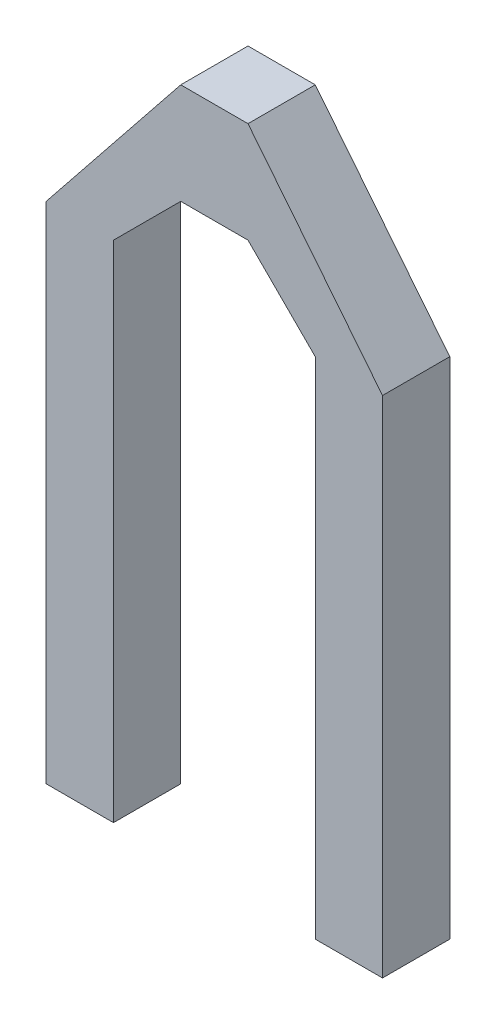
ISO-10303-21;
HEADER;
FILE_DESCRIPTION(('STEP AP214'),'2;1');
FILE_NAME('part.step','',(''),(''),'','','');
FILE_SCHEMA(('AUTOMOTIVE_DESIGN { 1 0 10303 214 1 1 1 1 }'));
ENDSEC;
DATA;
#1=APPLICATION_CONTEXT('core data for automotive mechanical design processes');
#2=APPLICATION_PROTOCOL_DEFINITION('international standard','automotive_design',2000,#1);
#3=PRODUCT_CONTEXT('',#1,'mechanical');
#4=PRODUCT('Part','Part','',(#3));
#5=PRODUCT_RELATED_PRODUCT_CATEGORY('part','',(#4));
#6=PRODUCT_DEFINITION_FORMATION('','',#4);
#7=PRODUCT_DEFINITION_CONTEXT('part definition',#1,'design');
#8=PRODUCT_DEFINITION('design','',#6,#7);
#9=PRODUCT_DEFINITION_SHAPE('','',#8);
#10=(LENGTH_UNIT() NAMED_UNIT(*) SI_UNIT(.MILLI.,.METRE.));
#11=(NAMED_UNIT(*) PLANE_ANGLE_UNIT() SI_UNIT($,.RADIAN.));
#12=(NAMED_UNIT(*) SI_UNIT($,.STERADIAN.) SOLID_ANGLE_UNIT());
#13=UNCERTAINTY_MEASURE_WITH_UNIT(LENGTH_MEASURE(1.E-05),#10,'distance_accuracy_value','');
#14=(GEOMETRIC_REPRESENTATION_CONTEXT(3) GLOBAL_UNCERTAINTY_ASSIGNED_CONTEXT((#13)) GLOBAL_UNIT_ASSIGNED_CONTEXT((#10,
#11,#12)) REPRESENTATION_CONTEXT('',''));
#15=CARTESIAN_POINT('',(0.,0.,0.));
#16=DIRECTION('',(0.,0.,1.));
#17=DIRECTION('',(1.,0.,0.));
#18=AXIS2_PLACEMENT_3D('',#15,#16,#17);
#19=CARTESIAN_POINT('',(0.0635,-0.127,0.0254));
#20=DIRECTION('',(0.,0.,1.));
#21=DIRECTION('',(1.,0.,0.));
#22=AXIS2_PLACEMENT_3D('',#19,#20,#21);
#23=PLANE('',#22);
#24=DIRECTION('',(0.,1.,0.));
#25=VECTOR('',#24,1.);
#26=CARTESIAN_POINT('',(0.0381,-0.127,0.0254));
#27=LINE('',#26,#25);
#28=CARTESIAN_POINT('',(0.0381,-0.127,0.0254));
#29=VERTEX_POINT('',#28);
#30=CARTESIAN_POINT('',(0.0381,0.06349999999998,0.0254));
#31=VERTEX_POINT('',#30);
#32=EDGE_CURVE('E157',#29,#31,#27,.T.);
#33=ORIENTED_EDGE('',*,*,#32,.F.);
#34=DIRECTION('',(1.,0.,0.));
#35=VECTOR('',#34,1.);
#36=CARTESIAN_POINT('',(0.0635,-0.127,0.0254));
#37=LINE('',#36,#35);
#38=CARTESIAN_POINT('',(0.0635,-0.127,0.0254));
#39=VERTEX_POINT('',#38);
#40=EDGE_CURVE('E118',#39,#29,#37,.F.);
#41=ORIENTED_EDGE('',*,*,#40,.F.);
#42=DIRECTION('',(0.,1.,0.));
#43=VECTOR('',#42,1.);
#44=CARTESIAN_POINT('',(0.0635,0.06349999999998,0.0254));
#45=LINE('',#44,#43);
#46=CARTESIAN_POINT('',(0.0634999999999975,0.063499999999978,0.0254));
#47=VERTEX_POINT('',#46);
#48=EDGE_CURVE('E20',#47,#39,#45,.F.);
#49=ORIENTED_EDGE('',*,*,#48,.F.);
#50=DIRECTION('',(-0.62469504755418,0.780868809443225,0.));
#51=VECTOR('',#50,1.);
#52=CARTESIAN_POINT('',(0.0127,0.127,0.0254));
#53=LINE('',#52,#51);
#54=CARTESIAN_POINT('',(0.0127,0.127,0.0254));
#55=VERTEX_POINT('',#54);
#56=EDGE_CURVE('E107',#55,#47,#53,.F.);
#57=ORIENTED_EDGE('',*,*,#56,.F.);
#58=DIRECTION('',(1.,0.,0.));
#59=VECTOR('',#58,1.);
#60=CARTESIAN_POINT('',(-0.0127,0.127,0.0254));
#61=LINE('',#60,#59);
#62=CARTESIAN_POINT('',(-0.0127000000000025,0.127000000000002,0.0254));
#63=VERTEX_POINT('',#62);
#64=EDGE_CURVE('E102',#63,#55,#61,.T.);
#65=ORIENTED_EDGE('',*,*,#64,.F.);
#66=DIRECTION('',(-0.62469504755418,-0.780868809443225,0.));
#67=VECTOR('',#66,1.);
#68=CARTESIAN_POINT('',(-0.0635,0.06349999999998,0.0254));
#69=LINE('',#68,#67);
#70=CARTESIAN_POINT('',(-0.0635,0.06349999999998,0.0254));
#71=VERTEX_POINT('',#70);
#72=EDGE_CURVE('E129',#71,#63,#69,.F.);
#73=ORIENTED_EDGE('',*,*,#72,.F.);
#74=DIRECTION('',(0.,1.,0.));
#75=VECTOR('',#74,1.);
#76=CARTESIAN_POINT('',(-0.0635,-0.127,0.0254));
#77=LINE('',#76,#75);
#78=CARTESIAN_POINT('',(-0.0635,-0.127,0.0254));
#79=VERTEX_POINT('',#78);
#80=EDGE_CURVE('E133',#79,#71,#77,.T.);
#81=ORIENTED_EDGE('',*,*,#80,.F.);
#82=DIRECTION('',(1.,0.,0.));
#83=VECTOR('',#82,1.);
#84=CARTESIAN_POINT('',(-0.0381,-0.127,0.0254));
#85=LINE('',#84,#83);
#86=CARTESIAN_POINT('',(-0.0381,-0.127,0.0254));
#87=VERTEX_POINT('',#86);
#88=EDGE_CURVE('E137',#87,#79,#85,.F.);
#89=ORIENTED_EDGE('',*,*,#88,.F.);
#90=DIRECTION('',(0.,1.,0.));
#91=VECTOR('',#90,1.);
#92=CARTESIAN_POINT('',(-0.0381,0.06349999999998,0.0254));
#93=LINE('',#92,#91);
#94=CARTESIAN_POINT('',(-0.038099999999998,0.063499999999978,0.0254));
#95=VERTEX_POINT('',#94);
#96=EDGE_CURVE('E141',#95,#87,#93,.F.);
#97=ORIENTED_EDGE('',*,*,#96,.F.);
#98=DIRECTION('',(0.707106781186048,0.707106781187048,0.));
#99=VECTOR('',#98,1.);
#100=CARTESIAN_POINT('',(-0.0127,0.0889,0.0254));
#101=LINE('',#100,#99);
#102=CARTESIAN_POINT('',(-0.0127,0.0889,0.0254));
#103=VERTEX_POINT('',#102);
#104=EDGE_CURVE('E145',#103,#95,#101,.F.);
#105=ORIENTED_EDGE('',*,*,#104,.F.);
#106=DIRECTION('',(1.,0.,0.));
#107=VECTOR('',#106,1.);
#108=CARTESIAN_POINT('',(0.0127,0.0889,0.0254));
#109=LINE('',#108,#107);
#110=CARTESIAN_POINT('',(0.012700000000002,0.088900000000002,0.0254));
#111=VERTEX_POINT('',#110);
#112=EDGE_CURVE('E149',#111,#103,#109,.F.);
#113=ORIENTED_EDGE('',*,*,#112,.F.);
#114=DIRECTION('',(0.707106781186048,-0.707106781187048,0.));
#115=VECTOR('',#114,1.);
#116=CARTESIAN_POINT('',(0.0381,0.06349999999998,0.0254));
#117=LINE('',#116,#115);
#118=EDGE_CURVE('E153',#31,#111,#117,.F.);
#119=ORIENTED_EDGE('',*,*,#118,.F.);
#120=EDGE_LOOP('',(#33,#41,#49,#57,#65,#73,#81,#89,#97,#105,#113,#119));
#121=FACE_BOUND('',#120,.T.);
#122=ADVANCED_FACE('F17',(#121),#23,.T.);
#123=CARTESIAN_POINT('',(0.0635,0.06349999999998,0.));
#124=DIRECTION('',(1.,0.,0.));
#125=DIRECTION('',(0.,0.,-1.));
#126=AXIS2_PLACEMENT_3D('',#123,#124,#125);
#127=PLANE('',#126);
#128=DIRECTION('',(0.,0.,-1.));
#129=VECTOR('',#128,1.);
#130=CARTESIAN_POINT('',(0.0635,-0.127,0.));
#131=LINE('',#130,#129);
#132=CARTESIAN_POINT('',(0.0635,-0.127,0.));
#133=VERTEX_POINT('',#132);
#134=EDGE_CURVE('E161',#133,#39,#131,.F.);
#135=ORIENTED_EDGE('',*,*,#134,.F.);
#136=DIRECTION('',(0.,1.,0.));
#137=VECTOR('',#136,1.);
#138=CARTESIAN_POINT('',(0.0635,-0.127,0.));
#139=LINE('',#138,#137);
#140=CARTESIAN_POINT('',(0.0634999999999975,0.063499999999978,0.));
#141=VERTEX_POINT('',#140);
#142=EDGE_CURVE('E124',#133,#141,#139,.T.);
#143=ORIENTED_EDGE('',*,*,#142,.T.);
#144=DIRECTION('',(0.,0.,1.));
#145=VECTOR('',#144,1.);
#146=CARTESIAN_POINT('',(0.0634999999999899,0.0634999999999719,0.));
#147=LINE('',#146,#145);
#148=EDGE_CURVE('E112',#47,#141,#147,.F.);
#149=ORIENTED_EDGE('',*,*,#148,.F.);
#150=ORIENTED_EDGE('',*,*,#48,.T.);
#151=EDGE_LOOP('',(#135,#143,#149,#150));
#152=FACE_BOUND('',#151,.T.);
#153=ADVANCED_FACE('F123',(#152),#127,.T.);
#154=CARTESIAN_POINT('',(0.0127,0.127,0.));
#155=DIRECTION('',(0.780868809443225,0.62469504755418,0.));
#156=DIRECTION('',(-0.62469504755418,0.780868809443225,0.));
#157=AXIS2_PLACEMENT_3D('',#154,#155,#156);
#158=PLANE('',#157);
#159=ORIENTED_EDGE('',*,*,#148,.T.);
#160=DIRECTION('',(-0.624695047554304,0.780868809443126,0.));
#161=VECTOR('',#160,1.);
#162=CARTESIAN_POINT('',(0.0635,0.06349999999998,0.));
#163=LINE('',#162,#161);
#164=CARTESIAN_POINT('',(0.0127,0.127,0.));
#165=VERTEX_POINT('',#164);
#166=EDGE_CURVE('E166',#141,#165,#163,.T.);
#167=ORIENTED_EDGE('',*,*,#166,.T.);
#168=DIRECTION('',(0.,0.,1.));
#169=VECTOR('',#168,1.);
#170=CARTESIAN_POINT('',(0.0127,0.127,0.));
#171=LINE('',#170,#169);
#172=EDGE_CURVE('E114',#55,#165,#171,.F.);
#173=ORIENTED_EDGE('',*,*,#172,.F.);
#174=ORIENTED_EDGE('',*,*,#56,.T.);
#175=EDGE_LOOP('',(#159,#167,#173,#174));
#176=FACE_BOUND('',#175,.T.);
#177=ADVANCED_FACE('F109',(#176),#158,.T.);
#178=CARTESIAN_POINT('',(-0.0127,0.127,0.));
#179=DIRECTION('',(0.,1.,0.));
#180=DIRECTION('',(0.,0.,1.));
#181=AXIS2_PLACEMENT_3D('',#178,#179,#180);
#182=PLANE('',#181);
#183=ORIENTED_EDGE('',*,*,#172,.T.);
#184=DIRECTION('',(1.,0.,0.));
#185=VECTOR('',#184,1.);
#186=CARTESIAN_POINT('',(0.0635,0.127,0.));
#187=LINE('',#186,#185);
#188=CARTESIAN_POINT('',(-0.0127000000000025,0.127000000000002,0.));
#189=VERTEX_POINT('',#188);
#190=EDGE_CURVE('E168',#165,#189,#187,.F.);
#191=ORIENTED_EDGE('',*,*,#190,.T.);
#192=DIRECTION('',(0.,0.,1.));
#193=VECTOR('',#192,1.);
#194=CARTESIAN_POINT('',(-0.0127000000000101,0.127000000000008,0.));
#195=LINE('',#194,#193);
#196=EDGE_CURVE('E131',#63,#189,#195,.F.);
#197=ORIENTED_EDGE('',*,*,#196,.F.);
#198=ORIENTED_EDGE('',*,*,#64,.T.);
#199=EDGE_LOOP('',(#183,#191,#197,#198));
#200=FACE_BOUND('',#199,.T.);
#201=ADVANCED_FACE('F234',(#200),#182,.T.);
#202=CARTESIAN_POINT('',(-0.0635,0.06349999999998,0.));
#203=DIRECTION('',(-0.780868809443225,0.62469504755418,0.));
#204=DIRECTION('',(-0.62469504755418,-0.780868809443225,0.));
#205=AXIS2_PLACEMENT_3D('',#202,#203,#204);
#206=PLANE('',#205);
#207=ORIENTED_EDGE('',*,*,#196,.T.);
#208=DIRECTION('',(-0.624695047554304,-0.780868809443126,0.));
#209=VECTOR('',#208,1.);
#210=CARTESIAN_POINT('',(-0.0127,0.127,0.));
#211=LINE('',#210,#209);
#212=CARTESIAN_POINT('',(-0.0635,0.06349999999998,0.));
#213=VERTEX_POINT('',#212);
#214=EDGE_CURVE('E171',#189,#213,#211,.T.);
#215=ORIENTED_EDGE('',*,*,#214,.T.);
#216=DIRECTION('',(0.,0.,1.));
#217=VECTOR('',#216,1.);
#218=CARTESIAN_POINT('',(-0.0635,0.06349999999998,0.));
#219=LINE('',#218,#217);
#220=EDGE_CURVE('E135',#71,#213,#219,.F.);
#221=ORIENTED_EDGE('',*,*,#220,.F.);
#222=ORIENTED_EDGE('',*,*,#72,.T.);
#223=EDGE_LOOP('',(#207,#215,#221,#222));
#224=FACE_BOUND('',#223,.T.);
#225=ADVANCED_FACE('F233',(#224),#206,.T.);
#226=CARTESIAN_POINT('',(-0.0635,-0.127,0.));
#227=DIRECTION('',(-1.,0.,0.));
#228=DIRECTION('',(0.,0.,1.));
#229=AXIS2_PLACEMENT_3D('',#226,#227,#228);
#230=PLANE('',#229);
#231=ORIENTED_EDGE('',*,*,#220,.T.);
#232=DIRECTION('',(0.,1.,0.));
#233=VECTOR('',#232,1.);
#234=CARTESIAN_POINT('',(-0.0635,-0.127,0.));
#235=LINE('',#234,#233);
#236=CARTESIAN_POINT('',(-0.0635,-0.127,0.));
#237=VERTEX_POINT('',#236);
#238=EDGE_CURVE('E174',#213,#237,#235,.F.);
#239=ORIENTED_EDGE('',*,*,#238,.T.);
#240=DIRECTION('',(0.,0.,-1.));
#241=VECTOR('',#240,1.);
#242=CARTESIAN_POINT('',(-0.0635,-0.127,0.));
#243=LINE('',#242,#241);
#244=EDGE_CURVE('E139',#79,#237,#243,.T.);
#245=ORIENTED_EDGE('',*,*,#244,.F.);
#246=ORIENTED_EDGE('',*,*,#80,.T.);
#247=EDGE_LOOP('',(#231,#239,#245,#246));
#248=FACE_BOUND('',#247,.T.);
#249=ADVANCED_FACE('F227',(#248),#230,.T.);
#250=CARTESIAN_POINT('',(-0.0381,-0.127,0.));
#251=DIRECTION('',(0.,-1.,0.));
#252=DIRECTION('',(0.,0.,-1.));
#253=AXIS2_PLACEMENT_3D('',#250,#251,#252);
#254=PLANE('',#253);
#255=ORIENTED_EDGE('',*,*,#244,.T.);
#256=DIRECTION('',(1.,0.,0.));
#257=VECTOR('',#256,1.);
#258=CARTESIAN_POINT('',(0.0635,-0.127,0.));
#259=LINE('',#258,#257);
#260=CARTESIAN_POINT('',(-0.0381,-0.127,0.));
#261=VERTEX_POINT('',#260);
#262=EDGE_CURVE('E177',#237,#261,#259,.T.);
#263=ORIENTED_EDGE('',*,*,#262,.T.);
#264=DIRECTION('',(0.,0.,-1.));
#265=VECTOR('',#264,1.);
#266=CARTESIAN_POINT('',(-0.0381,-0.127,0.));
#267=LINE('',#266,#265);
#268=EDGE_CURVE('E143',#87,#261,#267,.T.);
#269=ORIENTED_EDGE('',*,*,#268,.F.);
#270=ORIENTED_EDGE('',*,*,#88,.T.);
#271=EDGE_LOOP('',(#255,#263,#269,#270));
#272=FACE_BOUND('',#271,.T.);
#273=ADVANCED_FACE('F223',(#272),#254,.T.);
#274=CARTESIAN_POINT('',(-0.0381,0.06349999999998,0.));
#275=DIRECTION('',(1.,0.,0.));
#276=DIRECTION('',(0.,0.,-1.));
#277=AXIS2_PLACEMENT_3D('',#274,#275,#276);
#278=PLANE('',#277);
#279=ORIENTED_EDGE('',*,*,#268,.T.);
#280=DIRECTION('',(0.,1.,0.));
#281=VECTOR('',#280,1.);
#282=CARTESIAN_POINT('',(-0.0381,-0.127,0.));
#283=LINE('',#282,#281);
#284=CARTESIAN_POINT('',(-0.038099999999998,0.063499999999978,0.));
#285=VERTEX_POINT('',#284);
#286=EDGE_CURVE('E180',#261,#285,#283,.T.);
#287=ORIENTED_EDGE('',*,*,#286,.T.);
#288=DIRECTION('',(0.,0.,1.));
#289=VECTOR('',#288,1.);
#290=CARTESIAN_POINT('',(-0.038099999999992,0.063499999999972,0.));
#291=LINE('',#290,#289);
#292=EDGE_CURVE('E147',#95,#285,#291,.F.);
#293=ORIENTED_EDGE('',*,*,#292,.F.);
#294=ORIENTED_EDGE('',*,*,#96,.T.);
#295=EDGE_LOOP('',(#279,#287,#293,#294));
#296=FACE_BOUND('',#295,.T.);
#297=ADVANCED_FACE('F217',(#296),#278,.T.);
#298=CARTESIAN_POINT('',(-0.0127,0.0889,0.));
#299=DIRECTION('',(0.707106781187048,-0.707106781186048,0.));
#300=DIRECTION('',(0.707106781186048,0.707106781187048,0.));
#301=AXIS2_PLACEMENT_3D('',#298,#299,#300);
#302=PLANE('',#301);
#303=ORIENTED_EDGE('',*,*,#292,.T.);
#304=DIRECTION('',(0.70710678118627,0.707106781186825,0.));
#305=VECTOR('',#304,1.);
#306=CARTESIAN_POINT('',(-0.0381,0.06349999999998,0.));
#307=LINE('',#306,#305);
#308=CARTESIAN_POINT('',(-0.0127,0.0889,0.));
#309=VERTEX_POINT('',#308);
#310=EDGE_CURVE('E183',#285,#309,#307,.T.);
#311=ORIENTED_EDGE('',*,*,#310,.T.);
#312=DIRECTION('',(0.,0.,-1.));
#313=VECTOR('',#312,1.);
#314=CARTESIAN_POINT('',(-0.0127,0.0889,0.));
#315=LINE('',#314,#313);
#316=EDGE_CURVE('E151',#103,#309,#315,.T.);
#317=ORIENTED_EDGE('',*,*,#316,.F.);
#318=ORIENTED_EDGE('',*,*,#104,.T.);
#319=EDGE_LOOP('',(#303,#311,#317,#318));
#320=FACE_BOUND('',#319,.T.);
#321=ADVANCED_FACE('F213',(#320),#302,.T.);
#322=CARTESIAN_POINT('',(0.0127,0.0889,0.));
#323=DIRECTION('',(0.,-1.,0.));
#324=DIRECTION('',(0.,0.,-1.));
#325=AXIS2_PLACEMENT_3D('',#322,#323,#324);
#326=PLANE('',#325);
#327=ORIENTED_EDGE('',*,*,#316,.T.);
#328=DIRECTION('',(1.,0.,0.));
#329=VECTOR('',#328,1.);
#330=CARTESIAN_POINT('',(0.0635,0.0889,0.));
#331=LINE('',#330,#329);
#332=CARTESIAN_POINT('',(0.012700000000002,0.088900000000002,0.));
#333=VERTEX_POINT('',#332);
#334=EDGE_CURVE('E186',#309,#333,#331,.T.);
#335=ORIENTED_EDGE('',*,*,#334,.T.);
#336=DIRECTION('',(0.,0.,1.));
#337=VECTOR('',#336,1.);
#338=CARTESIAN_POINT('',(0.012700000000008,0.088900000000008,0.));
#339=LINE('',#338,#337);
#340=EDGE_CURVE('E155',#111,#333,#339,.F.);
#341=ORIENTED_EDGE('',*,*,#340,.F.);
#342=ORIENTED_EDGE('',*,*,#112,.T.);
#343=EDGE_LOOP('',(#327,#335,#341,#342));
#344=FACE_BOUND('',#343,.T.);
#345=ADVANCED_FACE('F207',(#344),#326,.T.);
#346=CARTESIAN_POINT('',(0.0381,0.06349999999998,0.));
#347=DIRECTION('',(-0.707106781187048,-0.707106781186048,0.));
#348=DIRECTION('',(0.707106781186048,-0.707106781187048,0.));
#349=AXIS2_PLACEMENT_3D('',#346,#347,#348);
#350=PLANE('',#349);
#351=ORIENTED_EDGE('',*,*,#340,.T.);
#352=DIRECTION('',(0.70710678118627,-0.707106781186825,0.));
#353=VECTOR('',#352,1.);
#354=CARTESIAN_POINT('',(0.0127,0.0889,0.));
#355=LINE('',#354,#353);
#356=CARTESIAN_POINT('',(0.0381,0.06349999999998,0.));
#357=VERTEX_POINT('',#356);
#358=EDGE_CURVE('E189',#333,#357,#355,.T.);
#359=ORIENTED_EDGE('',*,*,#358,.T.);
#360=DIRECTION('',(0.,0.,1.));
#361=VECTOR('',#360,1.);
#362=CARTESIAN_POINT('',(0.0381,0.06349999999998,0.));
#363=LINE('',#362,#361);
#364=EDGE_CURVE('E159',#31,#357,#363,.F.);
#365=ORIENTED_EDGE('',*,*,#364,.F.);
#366=ORIENTED_EDGE('',*,*,#118,.T.);
#367=EDGE_LOOP('',(#351,#359,#365,#366));
#368=FACE_BOUND('',#367,.T.);
#369=ADVANCED_FACE('F202',(#368),#350,.T.);
#370=CARTESIAN_POINT('',(0.0381,-0.127,0.));
#371=DIRECTION('',(-1.,0.,0.));
#372=DIRECTION('',(0.,0.,1.));
#373=AXIS2_PLACEMENT_3D('',#370,#371,#372);
#374=PLANE('',#373);
#375=ORIENTED_EDGE('',*,*,#364,.T.);
#376=DIRECTION('',(0.,1.,0.));
#377=VECTOR('',#376,1.);
#378=CARTESIAN_POINT('',(0.0381,-0.127,0.));
#379=LINE('',#378,#377);
#380=CARTESIAN_POINT('',(0.0381,-0.127,0.));
#381=VERTEX_POINT('',#380);
#382=EDGE_CURVE('E26',#357,#381,#379,.F.);
#383=ORIENTED_EDGE('',*,*,#382,.T.);
#384=DIRECTION('',(0.,0.,-1.));
#385=VECTOR('',#384,1.);
#386=CARTESIAN_POINT('',(0.0381,-0.127,0.));
#387=LINE('',#386,#385);
#388=EDGE_CURVE('E34',#29,#381,#387,.T.);
#389=ORIENTED_EDGE('',*,*,#388,.F.);
#390=ORIENTED_EDGE('',*,*,#32,.T.);
#391=EDGE_LOOP('',(#375,#383,#389,#390));
#392=FACE_BOUND('',#391,.T.);
#393=ADVANCED_FACE('F195',(#392),#374,.T.);
#394=CARTESIAN_POINT('',(0.0635,-0.127,0.));
#395=DIRECTION('',(0.,-1.,0.));
#396=DIRECTION('',(0.,0.,-1.));
#397=AXIS2_PLACEMENT_3D('',#394,#395,#396);
#398=PLANE('',#397);
#399=ORIENTED_EDGE('',*,*,#388,.T.);
#400=DIRECTION('',(1.,0.,0.));
#401=VECTOR('',#400,1.);
#402=CARTESIAN_POINT('',(0.0635,-0.127,0.));
#403=LINE('',#402,#401);
#404=EDGE_CURVE('E11',#381,#133,#403,.T.);
#405=ORIENTED_EDGE('',*,*,#404,.T.);
#406=ORIENTED_EDGE('',*,*,#134,.T.);
#407=ORIENTED_EDGE('',*,*,#40,.T.);
#408=EDGE_LOOP('',(#399,#405,#406,#407));
#409=FACE_BOUND('',#408,.T.);
#410=ADVANCED_FACE('F235',(#409),#398,.T.);
#411=CARTESIAN_POINT('',(0.0635,-0.127,0.));
#412=DIRECTION('',(0.,0.,1.));
#413=DIRECTION('',(1.,0.,0.));
#414=AXIS2_PLACEMENT_3D('',#411,#412,#413);
#415=PLANE('',#414);
#416=ORIENTED_EDGE('',*,*,#382,.F.);
#417=ORIENTED_EDGE('',*,*,#358,.F.);
#418=ORIENTED_EDGE('',*,*,#334,.F.);
#419=ORIENTED_EDGE('',*,*,#310,.F.);
#420=ORIENTED_EDGE('',*,*,#286,.F.);
#421=ORIENTED_EDGE('',*,*,#262,.F.);
#422=ORIENTED_EDGE('',*,*,#238,.F.);
#423=ORIENTED_EDGE('',*,*,#214,.F.);
#424=ORIENTED_EDGE('',*,*,#190,.F.);
#425=ORIENTED_EDGE('',*,*,#166,.F.);
#426=ORIENTED_EDGE('',*,*,#142,.F.);
#427=ORIENTED_EDGE('',*,*,#404,.F.);
#428=EDGE_LOOP('',(#416,#417,#418,#419,#420,#421,#422,#423,#424,#425,#426,#427));
#429=FACE_BOUND('',#428,.T.);
#430=ADVANCED_FACE('F199',(#429),#415,.F.);
#431=CLOSED_SHELL('',(#122,#153,#177,#201,#225,#249,#273,#297,#321,#345,#369,#393,#410,#430));
#432=MANIFOLD_SOLID_BREP('B1',#431);
#433=ADVANCED_BREP_SHAPE_REPRESENTATION('',(#18,#432),#14);
#434=SHAPE_DEFINITION_REPRESENTATION(#9,#433);
ENDSEC;
END-ISO-10303-21;
